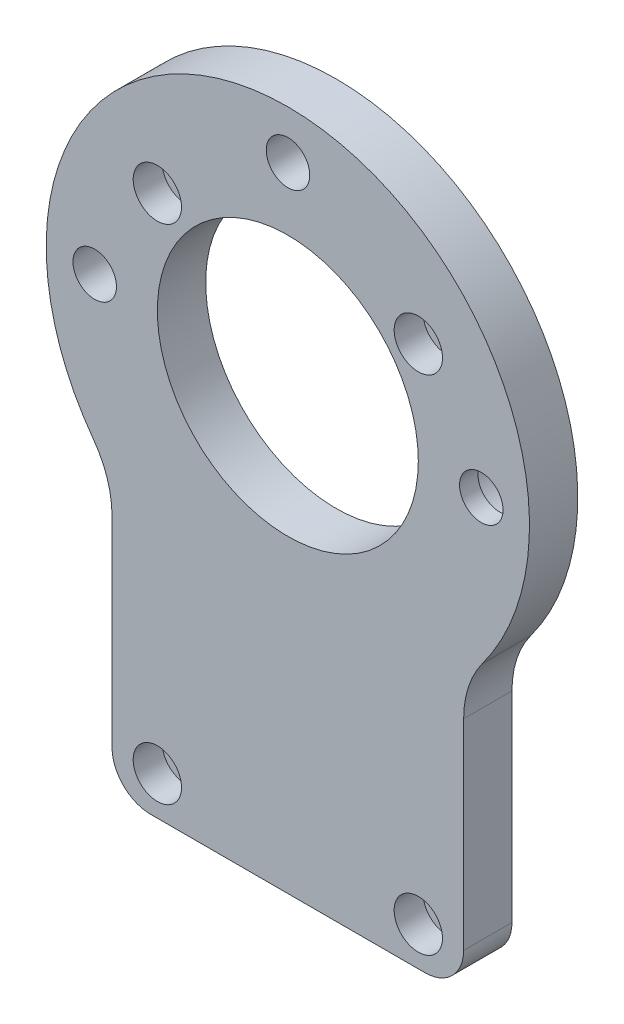
ISO-10303-21;
HEADER;
FILE_DESCRIPTION(('STEP AP214'),'2;1');
FILE_NAME('part.step','',(''),(''),'','','');
FILE_SCHEMA(('AUTOMOTIVE_DESIGN { 1 0 10303 214 1 1 1 1 }'));
ENDSEC;
DATA;
#1=APPLICATION_CONTEXT('core data for automotive mechanical design processes');
#2=APPLICATION_PROTOCOL_DEFINITION('international standard','automotive_design',2000,#1);
#3=PRODUCT_CONTEXT('',#1,'mechanical');
#4=PRODUCT('Part','Part','',(#3));
#5=PRODUCT_RELATED_PRODUCT_CATEGORY('part','',(#4));
#6=PRODUCT_DEFINITION_FORMATION('','',#4);
#7=PRODUCT_DEFINITION_CONTEXT('part definition',#1,'design');
#8=PRODUCT_DEFINITION('design','',#6,#7);
#9=PRODUCT_DEFINITION_SHAPE('','',#8);
#10=(LENGTH_UNIT() NAMED_UNIT(*) SI_UNIT(.MILLI.,.METRE.));
#11=(NAMED_UNIT(*) PLANE_ANGLE_UNIT() SI_UNIT($,.RADIAN.));
#12=(NAMED_UNIT(*) SI_UNIT($,.STERADIAN.) SOLID_ANGLE_UNIT());
#13=UNCERTAINTY_MEASURE_WITH_UNIT(LENGTH_MEASURE(1.E-05),#10,'distance_accuracy_value','');
#14=(GEOMETRIC_REPRESENTATION_CONTEXT(3) GLOBAL_UNCERTAINTY_ASSIGNED_CONTEXT((#13)) GLOBAL_UNIT_ASSIGNED_CONTEXT((#10,
#11,#12)) REPRESENTATION_CONTEXT('',''));
#15=CARTESIAN_POINT('',(0.,0.,0.));
#16=DIRECTION('',(0.,0.,1.));
#17=DIRECTION('',(1.,0.,0.));
#18=AXIS2_PLACEMENT_3D('',#15,#16,#17);
#19=CARTESIAN_POINT('',(0.,0.,0.));
#20=DIRECTION('',(0.,0.,1.));
#21=DIRECTION('',(1.,0.,0.));
#22=AXIS2_PLACEMENT_3D('',#19,#20,#21);
#23=PLANE('',#22);
#24=CARTESIAN_POINT('',(-19.9828483210245,15.4999999999999,0.));
#25=DIRECTION('',(0.,0.,1.));
#26=DIRECTION('',(1.,0.,0.));
#27=AXIS2_PLACEMENT_3D('',#24,#25,#26);
#28=CIRCLE('',#27,2.25);
#29=CARTESIAN_POINT('',(-17.7328483210245,15.4999999999999,0.));
#30=VERTEX_POINT('',#29);
#31=EDGE_CURVE('E262',#30,#30,#28,.T.);
#32=ORIENTED_EDGE('',*,*,#31,.T.);
#33=EDGE_LOOP('',(#32));
#34=FACE_BOUND('',#33,.T.);
#35=CARTESIAN_POINT('',(0.0171516789755077,35.5,0.));
#36=DIRECTION('',(0.,0.,1.));
#37=DIRECTION('',(1.,0.,0.));
#38=AXIS2_PLACEMENT_3D('',#35,#36,#37);
#39=CIRCLE('',#38,2.25);
#40=CARTESIAN_POINT('',(2.26715167897551,35.5,0.));
#41=VERTEX_POINT('',#40);
#42=EDGE_CURVE('E261',#41,#41,#39,.T.);
#43=ORIENTED_EDGE('',*,*,#42,.T.);
#44=EDGE_LOOP('',(#43));
#45=FACE_BOUND('',#44,.T.);
#46=CARTESIAN_POINT('',(0.,15.5,0.));
#47=DIRECTION('',(0.,0.,1.));
#48=DIRECTION('',(1.,0.,0.));
#49=AXIS2_PLACEMENT_3D('',#46,#47,#48);
#50=CIRCLE('',#49,13.5);
#51=CARTESIAN_POINT('',(13.5,15.5,0.));
#52=VERTEX_POINT('',#51);
#53=EDGE_CURVE('E139',#52,#52,#50,.T.);
#54=ORIENTED_EDGE('',*,*,#53,.T.);
#55=EDGE_LOOP('',(#54));
#56=FACE_BOUND('',#55,.T.);
#57=CARTESIAN_POINT('',(13.5,26.,0.));
#58=DIRECTION('',(0.,0.,1.));
#59=DIRECTION('',(1.,0.,0.));
#60=AXIS2_PLACEMENT_3D('',#57,#58,#59);
#61=CIRCLE('',#60,1.2);
#62=CARTESIAN_POINT('',(14.7,26.,0.));
#63=VERTEX_POINT('',#62);
#64=EDGE_CURVE('E142',#63,#63,#61,.T.);
#65=ORIENTED_EDGE('',*,*,#64,.T.);
#66=EDGE_LOOP('',(#65));
#67=FACE_BOUND('',#66,.T.);
#68=CARTESIAN_POINT('',(13.5,-26.,0.));
#69=DIRECTION('',(0.,0.,1.));
#70=DIRECTION('',(1.,0.,0.));
#71=AXIS2_PLACEMENT_3D('',#68,#69,#70);
#72=CIRCLE('',#71,1.2);
#73=CARTESIAN_POINT('',(14.7,-26.,0.));
#74=VERTEX_POINT('',#73);
#75=EDGE_CURVE('E145',#74,#74,#72,.T.);
#76=ORIENTED_EDGE('',*,*,#75,.T.);
#77=EDGE_LOOP('',(#76));
#78=FACE_BOUND('',#77,.T.);
#79=CARTESIAN_POINT('',(-13.5,-26.,0.));
#80=DIRECTION('',(0.,0.,1.));
#81=DIRECTION('',(1.,0.,0.));
#82=AXIS2_PLACEMENT_3D('',#79,#80,#81);
#83=CIRCLE('',#82,1.2);
#84=CARTESIAN_POINT('',(-12.3,-26.,0.));
#85=VERTEX_POINT('',#84);
#86=EDGE_CURVE('E148',#85,#85,#83,.T.);
#87=ORIENTED_EDGE('',*,*,#86,.T.);
#88=EDGE_LOOP('',(#87));
#89=FACE_BOUND('',#88,.T.);
#90=CARTESIAN_POINT('',(-28.1886362872403,-5.24610286935067,0.));
#91=DIRECTION('',(0.,0.,1.));
#92=DIRECTION('',(1.,0.,0.));
#93=AXIS2_PLACEMENT_3D('',#90,#91,#92);
#94=CIRCLE('',#93,10.);
#95=CARTESIAN_POINT('',(-18.1886362872403,-5.24610286935067,0.));
#96=VERTEX_POINT('',#95);
#97=CARTESIAN_POINT('',(-20.1347402051717,0.681355093320964,0.));
#98=VERTEX_POINT('',#97);
#99=EDGE_CURVE('E151',#96,#98,#94,.T.);
#100=ORIENTED_EDGE('',*,*,#99,.T.);
#101=CARTESIAN_POINT('',(0.,15.5,0.));
#102=DIRECTION('',(0.,0.,1.));
#103=DIRECTION('',(1.,0.,0.));
#104=AXIS2_PLACEMENT_3D('',#101,#102,#103);
#105=CIRCLE('',#104,25.);
#106=CARTESIAN_POINT('',(20.1347402051716,0.681355093320922,0.));
#107=VERTEX_POINT('',#106);
#108=EDGE_CURVE('E85',#107,#98,#105,.T.);
#109=ORIENTED_EDGE('',*,*,#108,.F.);
#110=CARTESIAN_POINT('',(28.1886362872403,-5.2461028693507,0.));
#111=DIRECTION('',(0.,0.,1.));
#112=DIRECTION('',(1.,0.,0.));
#113=AXIS2_PLACEMENT_3D('',#110,#111,#112);
#114=CIRCLE('',#113,10.);
#115=CARTESIAN_POINT('',(18.1886362872403,-5.2461028693507,0.));
#116=VERTEX_POINT('',#115);
#117=EDGE_CURVE('E166',#116,#107,#114,.F.);
#118=ORIENTED_EDGE('',*,*,#117,.F.);
#119=DIRECTION('',(0.,-1.,0.));
#120=VECTOR('',#119,1.);
#121=CARTESIAN_POINT('',(18.1886362872403,0.,0.));
#122=LINE('',#121,#120);
#123=CARTESIAN_POINT('',(18.1886362872403,-26.,0.));
#124=VERTEX_POINT('',#123);
#125=EDGE_CURVE('E118',#116,#124,#122,.T.);
#126=ORIENTED_EDGE('',*,*,#125,.T.);
#127=CARTESIAN_POINT('',(14.1886362872403,-26.,0.));
#128=DIRECTION('',(0.,0.,1.));
#129=DIRECTION('',(1.,0.,0.));
#130=AXIS2_PLACEMENT_3D('',#127,#128,#129);
#131=CIRCLE('',#130,4.);
#132=CARTESIAN_POINT('',(14.1886362872403,-30.,0.));
#133=VERTEX_POINT('',#132);
#134=EDGE_CURVE('E162',#124,#133,#131,.F.);
#135=ORIENTED_EDGE('',*,*,#134,.T.);
#136=DIRECTION('',(-1.,0.,0.));
#137=VECTOR('',#136,1.);
#138=CARTESIAN_POINT('',(0.,-30.,0.));
#139=LINE('',#138,#137);
#140=CARTESIAN_POINT('',(-14.1886362872403,-30.,0.));
#141=VERTEX_POINT('',#140);
#142=EDGE_CURVE('E159',#133,#141,#139,.T.);
#143=ORIENTED_EDGE('',*,*,#142,.T.);
#144=CARTESIAN_POINT('',(-14.1886362872403,-26.,0.));
#145=DIRECTION('',(0.,0.,1.));
#146=DIRECTION('',(1.,0.,0.));
#147=AXIS2_PLACEMENT_3D('',#144,#145,#146);
#148=CIRCLE('',#147,4.);
#149=CARTESIAN_POINT('',(-18.1886362872403,-26.,0.));
#150=VERTEX_POINT('',#149);
#151=EDGE_CURVE('E156',#141,#150,#148,.F.);
#152=ORIENTED_EDGE('',*,*,#151,.T.);
#153=DIRECTION('',(0.,-1.,0.));
#154=VECTOR('',#153,1.);
#155=CARTESIAN_POINT('',(-18.1886362872403,0.,0.));
#156=LINE('',#155,#154);
#157=EDGE_CURVE('E153',#96,#150,#156,.T.);
#158=ORIENTED_EDGE('',*,*,#157,.F.);
#159=EDGE_LOOP('',(#100,#109,#118,#126,#135,#143,#152,#158));
#160=FACE_BOUND('',#159,.T.);
#161=CARTESIAN_POINT('',(-13.5,26.,0.));
#162=DIRECTION('',(0.,0.,1.));
#163=DIRECTION('',(1.,0.,0.));
#164=AXIS2_PLACEMENT_3D('',#161,#162,#163);
#165=CIRCLE('',#164,1.2);
#166=CARTESIAN_POINT('',(-12.3,26.,0.));
#167=VERTEX_POINT('',#166);
#168=EDGE_CURVE('E169',#167,#167,#165,.T.);
#169=ORIENTED_EDGE('',*,*,#168,.T.);
#170=EDGE_LOOP('',(#169));
#171=FACE_BOUND('',#170,.T.);
#172=CARTESIAN_POINT('',(20.0171516789755,15.4999999999999,0.));
#173=DIRECTION('',(0.,0.,-1.));
#174=DIRECTION('',(-1.,0.,0.));
#175=AXIS2_PLACEMENT_3D('',#172,#173,#174);
#176=CIRCLE('',#175,4.49999999999999);
#177=CARTESIAN_POINT('',(15.5171516789755,15.4999999999999,0.));
#178=VERTEX_POINT('',#177);
#179=EDGE_CURVE('E248',#178,#178,#176,.T.);
#180=ORIENTED_EDGE('',*,*,#179,.F.);
#181=EDGE_LOOP('',(#180));
#182=FACE_BOUND('',#181,.T.);
#183=ADVANCED_FACE('F38',(#34,#45,#56,#67,#78,#89,#160,#171,#182),#23,.F.);
#184=CARTESIAN_POINT('',(-13.5,-26.,5.));
#185=DIRECTION('',(0.,0.,-1.));
#186=DIRECTION('',(-1.,0.,0.));
#187=AXIS2_PLACEMENT_3D('',#184,#185,#186);
#188=CYLINDRICAL_SURFACE('',#187,1.2);
#189=ORIENTED_EDGE('',*,*,#86,.F.);
#190=EDGE_LOOP('',(#189));
#191=FACE_BOUND('',#190,.T.);
#192=CARTESIAN_POINT('',(-13.5,-26.,2.));
#193=DIRECTION('',(0.,0.,1.));
#194=DIRECTION('',(1.,0.,0.));
#195=AXIS2_PLACEMENT_3D('',#192,#193,#194);
#196=CIRCLE('',#195,1.2);
#197=CARTESIAN_POINT('',(-12.3,-26.,2.));
#198=VERTEX_POINT('',#197);
#199=EDGE_CURVE('E42',#198,#198,#196,.T.);
#200=ORIENTED_EDGE('',*,*,#199,.T.);
#201=EDGE_LOOP('',(#200));
#202=FACE_BOUND('',#201,.T.);
#203=ADVANCED_FACE('F194',(#191,#202),#188,.F.);
#204=CARTESIAN_POINT('',(13.5,-26.,5.));
#205=DIRECTION('',(0.,0.,-1.));
#206=DIRECTION('',(-1.,0.,0.));
#207=AXIS2_PLACEMENT_3D('',#204,#205,#206);
#208=CYLINDRICAL_SURFACE('',#207,1.2);
#209=ORIENTED_EDGE('',*,*,#75,.F.);
#210=EDGE_LOOP('',(#209));
#211=FACE_BOUND('',#210,.T.);
#212=CARTESIAN_POINT('',(13.5,-26.,2.));
#213=DIRECTION('',(0.,0.,1.));
#214=DIRECTION('',(1.,0.,0.));
#215=AXIS2_PLACEMENT_3D('',#212,#213,#214);
#216=CIRCLE('',#215,1.2);
#217=CARTESIAN_POINT('',(14.7,-26.,2.));
#218=VERTEX_POINT('',#217);
#219=EDGE_CURVE('E187',#218,#218,#216,.T.);
#220=ORIENTED_EDGE('',*,*,#219,.T.);
#221=EDGE_LOOP('',(#220));
#222=FACE_BOUND('',#221,.T.);
#223=ADVANCED_FACE('F313',(#211,#222),#208,.F.);
#224=CARTESIAN_POINT('',(13.5,26.,5.));
#225=DIRECTION('',(0.,0.,-1.));
#226=DIRECTION('',(-1.,0.,0.));
#227=AXIS2_PLACEMENT_3D('',#224,#225,#226);
#228=CYLINDRICAL_SURFACE('',#227,1.2);
#229=ORIENTED_EDGE('',*,*,#64,.F.);
#230=EDGE_LOOP('',(#229));
#231=FACE_BOUND('',#230,.T.);
#232=CARTESIAN_POINT('',(13.5,26.,2.));
#233=DIRECTION('',(0.,0.,1.));
#234=DIRECTION('',(1.,0.,0.));
#235=AXIS2_PLACEMENT_3D('',#232,#233,#234);
#236=CIRCLE('',#235,1.2);
#237=CARTESIAN_POINT('',(14.7,26.,2.));
#238=VERTEX_POINT('',#237);
#239=EDGE_CURVE('E184',#238,#238,#236,.T.);
#240=ORIENTED_EDGE('',*,*,#239,.T.);
#241=EDGE_LOOP('',(#240));
#242=FACE_BOUND('',#241,.T.);
#243=ADVANCED_FACE('F318',(#231,#242),#228,.F.);
#244=CARTESIAN_POINT('',(-13.5,26.,5.));
#245=DIRECTION('',(0.,0.,-1.));
#246=DIRECTION('',(-1.,0.,0.));
#247=AXIS2_PLACEMENT_3D('',#244,#245,#246);
#248=CYLINDRICAL_SURFACE('',#247,1.2);
#249=ORIENTED_EDGE('',*,*,#168,.F.);
#250=EDGE_LOOP('',(#249));
#251=FACE_BOUND('',#250,.T.);
#252=CARTESIAN_POINT('',(-13.5,26.,2.));
#253=DIRECTION('',(0.,0.,1.));
#254=DIRECTION('',(1.,0.,0.));
#255=AXIS2_PLACEMENT_3D('',#252,#253,#254);
#256=CIRCLE('',#255,1.2);
#257=CARTESIAN_POINT('',(-12.3,26.,2.));
#258=VERTEX_POINT('',#257);
#259=EDGE_CURVE('E181',#258,#258,#256,.T.);
#260=ORIENTED_EDGE('',*,*,#259,.T.);
#261=EDGE_LOOP('',(#260));
#262=FACE_BOUND('',#261,.T.);
#263=ADVANCED_FACE('F325',(#251,#262),#248,.F.);
#264=CARTESIAN_POINT('',(-28.1886362872403,-5.24610286935067,5.));
#265=DIRECTION('',(0.,0.,-1.));
#266=DIRECTION('',(-1.,0.,0.));
#267=AXIS2_PLACEMENT_3D('',#264,#265,#266);
#268=CYLINDRICAL_SURFACE('',#267,10.);
#269=ORIENTED_EDGE('',*,*,#99,.F.);
#270=DIRECTION('',(0.,0.,-1.));
#271=VECTOR('',#270,1.);
#272=CARTESIAN_POINT('',(-18.1886362872403,-5.24610286935067,5.));
#273=LINE('',#272,#271);
#274=CARTESIAN_POINT('',(-18.1886362872403,-5.24610286935067,5.));
#275=VERTEX_POINT('',#274);
#276=EDGE_CURVE('E11',#275,#96,#273,.T.);
#277=ORIENTED_EDGE('',*,*,#276,.F.);
#278=CARTESIAN_POINT('',(-28.1886362872403,-5.24610286935067,5.));
#279=DIRECTION('',(0.,0.,1.));
#280=DIRECTION('',(1.,0.,0.));
#281=AXIS2_PLACEMENT_3D('',#278,#279,#280);
#282=CIRCLE('',#281,10.);
#283=CARTESIAN_POINT('',(-20.1347402051717,0.681355093320964,5.));
#284=VERTEX_POINT('',#283);
#285=EDGE_CURVE('E224',#275,#284,#282,.T.);
#286=ORIENTED_EDGE('',*,*,#285,.T.);
#287=DIRECTION('',(0.,0.,-1.));
#288=VECTOR('',#287,1.);
#289=CARTESIAN_POINT('',(-20.1347402051717,0.681355093320964,5.));
#290=LINE('',#289,#288);
#291=EDGE_CURVE('E92',#284,#98,#290,.T.);
#292=ORIENTED_EDGE('',*,*,#291,.T.);
#293=EDGE_LOOP('',(#269,#277,#286,#292));
#294=FACE_BOUND('',#293,.T.);
#295=ADVANCED_FACE('F322',(#294),#268,.F.);
#296=CARTESIAN_POINT('',(-18.1886362872403,0.,5.));
#297=DIRECTION('',(1.,0.,0.));
#298=DIRECTION('',(0.,1.,0.));
#299=AXIS2_PLACEMENT_3D('',#296,#297,#298);
#300=PLANE('',#299);
#301=ORIENTED_EDGE('',*,*,#157,.T.);
#302=DIRECTION('',(0.,0.,-1.));
#303=VECTOR('',#302,1.);
#304=CARTESIAN_POINT('',(-18.1886362872403,-26.,5.));
#305=LINE('',#304,#303);
#306=CARTESIAN_POINT('',(-18.1886362872403,-26.,5.));
#307=VERTEX_POINT('',#306);
#308=EDGE_CURVE('E48',#307,#150,#305,.T.);
#309=ORIENTED_EDGE('',*,*,#308,.F.);
#310=DIRECTION('',(0.,-1.,0.));
#311=VECTOR('',#310,1.);
#312=CARTESIAN_POINT('',(-18.1886362872403,0.,5.));
#313=LINE('',#312,#311);
#314=EDGE_CURVE('E226',#275,#307,#313,.T.);
#315=ORIENTED_EDGE('',*,*,#314,.F.);
#316=ORIENTED_EDGE('',*,*,#276,.T.);
#317=EDGE_LOOP('',(#301,#309,#315,#316));
#318=FACE_BOUND('',#317,.T.);
#319=ADVANCED_FACE('F371',(#318),#300,.F.);
#320=CARTESIAN_POINT('',(-14.1886362872403,-26.,5.));
#321=DIRECTION('',(0.,0.,-1.));
#322=DIRECTION('',(-1.,0.,0.));
#323=AXIS2_PLACEMENT_3D('',#320,#321,#322);
#324=CYLINDRICAL_SURFACE('',#323,4.);
#325=ORIENTED_EDGE('',*,*,#151,.F.);
#326=DIRECTION('',(0.,0.,-1.));
#327=VECTOR('',#326,1.);
#328=CARTESIAN_POINT('',(-14.1886362872403,-30.,5.));
#329=LINE('',#328,#327);
#330=CARTESIAN_POINT('',(-14.1886362872403,-30.,5.));
#331=VERTEX_POINT('',#330);
#332=EDGE_CURVE('E178',#331,#141,#329,.T.);
#333=ORIENTED_EDGE('',*,*,#332,.F.);
#334=CARTESIAN_POINT('',(-14.1886362872403,-26.,5.));
#335=DIRECTION('',(0.,0.,1.));
#336=DIRECTION('',(1.,0.,0.));
#337=AXIS2_PLACEMENT_3D('',#334,#335,#336);
#338=CIRCLE('',#337,4.);
#339=EDGE_CURVE('E228',#331,#307,#338,.F.);
#340=ORIENTED_EDGE('',*,*,#339,.T.);
#341=ORIENTED_EDGE('',*,*,#308,.T.);
#342=EDGE_LOOP('',(#325,#333,#340,#341));
#343=FACE_BOUND('',#342,.T.);
#344=ADVANCED_FACE('F369',(#343),#324,.T.);
#345=CARTESIAN_POINT('',(0.,-30.,5.));
#346=DIRECTION('',(0.,-1.,0.));
#347=DIRECTION('',(1.,0.,0.));
#348=AXIS2_PLACEMENT_3D('',#345,#346,#347);
#349=PLANE('',#348);
#350=ORIENTED_EDGE('',*,*,#142,.F.);
#351=DIRECTION('',(0.,0.,-1.));
#352=VECTOR('',#351,1.);
#353=CARTESIAN_POINT('',(14.1886362872403,-30.,5.));
#354=LINE('',#353,#352);
#355=CARTESIAN_POINT('',(14.1886362872403,-30.,5.));
#356=VERTEX_POINT('',#355);
#357=EDGE_CURVE('E176',#356,#133,#354,.T.);
#358=ORIENTED_EDGE('',*,*,#357,.F.);
#359=DIRECTION('',(-1.,0.,0.));
#360=VECTOR('',#359,1.);
#361=CARTESIAN_POINT('',(0.,-30.,5.));
#362=LINE('',#361,#360);
#363=EDGE_CURVE('E134',#356,#331,#362,.T.);
#364=ORIENTED_EDGE('',*,*,#363,.T.);
#365=ORIENTED_EDGE('',*,*,#332,.T.);
#366=EDGE_LOOP('',(#350,#358,#364,#365));
#367=FACE_BOUND('',#366,.T.);
#368=ADVANCED_FACE('F233',(#367),#349,.T.);
#369=CARTESIAN_POINT('',(14.1886362872403,-26.,5.));
#370=DIRECTION('',(0.,0.,-1.));
#371=DIRECTION('',(-1.,0.,0.));
#372=AXIS2_PLACEMENT_3D('',#369,#370,#371);
#373=CYLINDRICAL_SURFACE('',#372,4.);
#374=ORIENTED_EDGE('',*,*,#134,.F.);
#375=DIRECTION('',(0.,0.,-1.));
#376=VECTOR('',#375,1.);
#377=CARTESIAN_POINT('',(18.1886362872403,-26.,5.));
#378=LINE('',#377,#376);
#379=CARTESIAN_POINT('',(18.1886362872403,-26.,5.));
#380=VERTEX_POINT('',#379);
#381=EDGE_CURVE('E121',#380,#124,#378,.T.);
#382=ORIENTED_EDGE('',*,*,#381,.F.);
#383=CARTESIAN_POINT('',(14.1886362872403,-26.,5.));
#384=DIRECTION('',(0.,0.,1.));
#385=DIRECTION('',(1.,0.,0.));
#386=AXIS2_PLACEMENT_3D('',#383,#384,#385);
#387=CIRCLE('',#386,4.);
#388=EDGE_CURVE('E132',#380,#356,#387,.F.);
#389=ORIENTED_EDGE('',*,*,#388,.T.);
#390=ORIENTED_EDGE('',*,*,#357,.T.);
#391=EDGE_LOOP('',(#374,#382,#389,#390));
#392=FACE_BOUND('',#391,.T.);
#393=ADVANCED_FACE('F238',(#392),#373,.T.);
#394=CARTESIAN_POINT('',(18.1886362872403,0.,5.));
#395=DIRECTION('',(1.,0.,0.));
#396=DIRECTION('',(0.,1.,0.));
#397=AXIS2_PLACEMENT_3D('',#394,#395,#396);
#398=PLANE('',#397);
#399=ORIENTED_EDGE('',*,*,#125,.F.);
#400=DIRECTION('',(0.,0.,-1.));
#401=VECTOR('',#400,1.);
#402=CARTESIAN_POINT('',(18.1886362872403,-5.2461028693507,5.));
#403=LINE('',#402,#401);
#404=CARTESIAN_POINT('',(18.1886362872403,-5.2461028693507,5.));
#405=VERTEX_POINT('',#404);
#406=EDGE_CURVE('E112',#405,#116,#403,.T.);
#407=ORIENTED_EDGE('',*,*,#406,.F.);
#408=DIRECTION('',(0.,-1.,0.));
#409=VECTOR('',#408,1.);
#410=CARTESIAN_POINT('',(18.1886362872403,0.,5.));
#411=LINE('',#410,#409);
#412=EDGE_CURVE('E116',#405,#380,#411,.T.);
#413=ORIENTED_EDGE('',*,*,#412,.T.);
#414=ORIENTED_EDGE('',*,*,#381,.T.);
#415=EDGE_LOOP('',(#399,#407,#413,#414));
#416=FACE_BOUND('',#415,.T.);
#417=ADVANCED_FACE('F114',(#416),#398,.T.);
#418=CARTESIAN_POINT('',(28.1886362872403,-5.2461028693507,5.));
#419=DIRECTION('',(0.,0.,-1.));
#420=DIRECTION('',(-1.,0.,0.));
#421=AXIS2_PLACEMENT_3D('',#418,#419,#420);
#422=CYLINDRICAL_SURFACE('',#421,10.);
#423=ORIENTED_EDGE('',*,*,#117,.T.);
#424=DIRECTION('',(0.,0.,-1.));
#425=VECTOR('',#424,1.);
#426=CARTESIAN_POINT('',(20.1347402051716,0.681355093320922,5.));
#427=LINE('',#426,#425);
#428=CARTESIAN_POINT('',(20.1347402051716,0.681355093320922,5.));
#429=VERTEX_POINT('',#428);
#430=EDGE_CURVE('E122',#429,#107,#427,.T.);
#431=ORIENTED_EDGE('',*,*,#430,.F.);
#432=CARTESIAN_POINT('',(28.1886362872403,-5.2461028693507,5.));
#433=DIRECTION('',(0.,0.,1.));
#434=DIRECTION('',(1.,0.,0.));
#435=AXIS2_PLACEMENT_3D('',#432,#433,#434);
#436=CIRCLE('',#435,10.);
#437=EDGE_CURVE('E125',#405,#429,#436,.F.);
#438=ORIENTED_EDGE('',*,*,#437,.F.);
#439=ORIENTED_EDGE('',*,*,#406,.T.);
#440=EDGE_LOOP('',(#423,#431,#438,#439));
#441=FACE_BOUND('',#440,.T.);
#442=ADVANCED_FACE('F126',(#441),#422,.F.);
#443=CARTESIAN_POINT('',(0.,15.5,5.));
#444=DIRECTION('',(0.,0.,-1.));
#445=DIRECTION('',(-1.,0.,0.));
#446=AXIS2_PLACEMENT_3D('',#443,#444,#445);
#447=CYLINDRICAL_SURFACE('',#446,25.);
#448=ORIENTED_EDGE('',*,*,#108,.T.);
#449=ORIENTED_EDGE('',*,*,#291,.F.);
#450=CARTESIAN_POINT('',(0.,15.5,5.));
#451=DIRECTION('',(0.,0.,1.));
#452=DIRECTION('',(1.,0.,0.));
#453=AXIS2_PLACEMENT_3D('',#450,#451,#452);
#454=CIRCLE('',#453,25.);
#455=EDGE_CURVE('E57',#429,#284,#454,.T.);
#456=ORIENTED_EDGE('',*,*,#455,.F.);
#457=ORIENTED_EDGE('',*,*,#430,.T.);
#458=EDGE_LOOP('',(#448,#449,#456,#457));
#459=FACE_BOUND('',#458,.T.);
#460=ADVANCED_FACE('F302',(#459),#447,.T.);
#461=CARTESIAN_POINT('',(0.,15.5,5.));
#462=DIRECTION('',(0.,0.,-1.));
#463=DIRECTION('',(-1.,0.,0.));
#464=AXIS2_PLACEMENT_3D('',#461,#462,#463);
#465=CYLINDRICAL_SURFACE('',#464,13.5);
#466=CARTESIAN_POINT('',(0.,15.5,5.));
#467=DIRECTION('',(0.,0.,1.));
#468=DIRECTION('',(1.,0.,0.));
#469=AXIS2_PLACEMENT_3D('',#466,#467,#468);
#470=CIRCLE('',#469,13.5);
#471=CARTESIAN_POINT('',(13.5,15.5,5.));
#472=VERTEX_POINT('',#471);
#473=EDGE_CURVE('E172',#472,#472,#470,.T.);
#474=ORIENTED_EDGE('',*,*,#473,.T.);
#475=EDGE_LOOP('',(#474));
#476=FACE_BOUND('',#475,.T.);
#477=ORIENTED_EDGE('',*,*,#53,.F.);
#478=EDGE_LOOP('',(#477));
#479=FACE_BOUND('',#478,.T.);
#480=ADVANCED_FACE('F40',(#476,#479),#465,.F.);
#481=CARTESIAN_POINT('',(0.,0.,5.));
#482=DIRECTION('',(0.,0.,1.));
#483=DIRECTION('',(1.,0.,0.));
#484=AXIS2_PLACEMENT_3D('',#481,#482,#483);
#485=PLANE('',#484);
#486=CARTESIAN_POINT('',(20.0171516789755,15.4999999999999,5.));
#487=DIRECTION('',(0.,0.,-1.));
#488=DIRECTION('',(-1.,0.,0.));
#489=AXIS2_PLACEMENT_3D('',#486,#487,#488);
#490=CIRCLE('',#489,2.25);
#491=CARTESIAN_POINT('',(17.7671516789755,15.4999999999999,5.));
#492=VERTEX_POINT('',#491);
#493=EDGE_CURVE('E258',#492,#492,#490,.T.);
#494=ORIENTED_EDGE('',*,*,#493,.T.);
#495=EDGE_LOOP('',(#494));
#496=FACE_BOUND('',#495,.T.);
#497=CARTESIAN_POINT('',(-19.9828483210245,15.4999999999999,5.));
#498=DIRECTION('',(0.,0.,1.));
#499=DIRECTION('',(1.,0.,0.));
#500=AXIS2_PLACEMENT_3D('',#497,#498,#499);
#501=CIRCLE('',#500,2.25);
#502=CARTESIAN_POINT('',(-17.7328483210245,15.4999999999999,5.));
#503=VERTEX_POINT('',#502);
#504=EDGE_CURVE('E270',#503,#503,#501,.T.);
#505=ORIENTED_EDGE('',*,*,#504,.F.);
#506=EDGE_LOOP('',(#505));
#507=FACE_BOUND('',#506,.T.);
#508=CARTESIAN_POINT('',(0.0171516789755077,35.5,5.));
#509=DIRECTION('',(0.,0.,1.));
#510=DIRECTION('',(1.,0.,0.));
#511=AXIS2_PLACEMENT_3D('',#508,#509,#510);
#512=CIRCLE('',#511,2.25);
#513=CARTESIAN_POINT('',(2.26715167897551,35.5,5.));
#514=VERTEX_POINT('',#513);
#515=EDGE_CURVE('E265',#514,#514,#512,.T.);
#516=ORIENTED_EDGE('',*,*,#515,.F.);
#517=EDGE_LOOP('',(#516));
#518=FACE_BOUND('',#517,.T.);
#519=CARTESIAN_POINT('',(13.5,26.,5.));
#520=DIRECTION('',(0.,0.,1.));
#521=DIRECTION('',(1.,0.,0.));
#522=AXIS2_PLACEMENT_3D('',#519,#520,#521);
#523=CIRCLE('',#522,2.5);
#524=CARTESIAN_POINT('',(16.,26.,5.));
#525=VERTEX_POINT('',#524);
#526=EDGE_CURVE('E206',#525,#525,#523,.T.);
#527=ORIENTED_EDGE('',*,*,#526,.F.);
#528=EDGE_LOOP('',(#527));
#529=FACE_BOUND('',#528,.T.);
#530=CARTESIAN_POINT('',(-13.5,-26.,5.));
#531=DIRECTION('',(0.,0.,1.));
#532=DIRECTION('',(1.,0.,0.));
#533=AXIS2_PLACEMENT_3D('',#530,#531,#532);
#534=CIRCLE('',#533,2.5);
#535=CARTESIAN_POINT('',(-11.,-26.,5.));
#536=VERTEX_POINT('',#535);
#537=EDGE_CURVE('E207',#536,#536,#534,.T.);
#538=ORIENTED_EDGE('',*,*,#537,.F.);
#539=EDGE_LOOP('',(#538));
#540=FACE_BOUND('',#539,.T.);
#541=CARTESIAN_POINT('',(13.5,-26.,5.));
#542=DIRECTION('',(0.,0.,1.));
#543=DIRECTION('',(1.,0.,0.));
#544=AXIS2_PLACEMENT_3D('',#541,#542,#543);
#545=CIRCLE('',#544,2.5);
#546=CARTESIAN_POINT('',(16.,-26.,5.));
#547=VERTEX_POINT('',#546);
#548=EDGE_CURVE('E273',#547,#547,#545,.T.);
#549=ORIENTED_EDGE('',*,*,#548,.F.);
#550=EDGE_LOOP('',(#549));
#551=FACE_BOUND('',#550,.T.);
#552=CARTESIAN_POINT('',(-13.5,26.,5.));
#553=DIRECTION('',(0.,0.,1.));
#554=DIRECTION('',(1.,0.,0.));
#555=AXIS2_PLACEMENT_3D('',#552,#553,#554);
#556=CIRCLE('',#555,2.5);
#557=CARTESIAN_POINT('',(-11.,26.,5.));
#558=VERTEX_POINT('',#557);
#559=EDGE_CURVE('E219',#558,#558,#556,.T.);
#560=ORIENTED_EDGE('',*,*,#559,.F.);
#561=EDGE_LOOP('',(#560));
#562=FACE_BOUND('',#561,.T.);
#563=ORIENTED_EDGE('',*,*,#473,.F.);
#564=EDGE_LOOP('',(#563));
#565=FACE_BOUND('',#564,.T.);
#566=ORIENTED_EDGE('',*,*,#285,.F.);
#567=ORIENTED_EDGE('',*,*,#314,.T.);
#568=ORIENTED_EDGE('',*,*,#339,.F.);
#569=ORIENTED_EDGE('',*,*,#363,.F.);
#570=ORIENTED_EDGE('',*,*,#388,.F.);
#571=ORIENTED_EDGE('',*,*,#412,.F.);
#572=ORIENTED_EDGE('',*,*,#437,.T.);
#573=ORIENTED_EDGE('',*,*,#455,.T.);
#574=EDGE_LOOP('',(#566,#567,#568,#569,#570,#571,#572,#573));
#575=FACE_BOUND('',#574,.T.);
#576=ADVANCED_FACE('F129',(#496,#507,#518,#529,#540,#551,#562,#565,#575),#485,.T.);
#577=CARTESIAN_POINT('',(-13.5,26.,2.));
#578=DIRECTION('',(0.,0.,1.));
#579=DIRECTION('',(1.,0.,0.));
#580=AXIS2_PLACEMENT_3D('',#577,#578,#579);
#581=CYLINDRICAL_SURFACE('',#580,2.5);
#582=CARTESIAN_POINT('',(-13.5,26.,2.));
#583=DIRECTION('',(0.,0.,1.));
#584=DIRECTION('',(1.,0.,0.));
#585=AXIS2_PLACEMENT_3D('',#582,#583,#584);
#586=CIRCLE('',#585,2.5);
#587=CARTESIAN_POINT('',(-11.,26.,2.));
#588=VERTEX_POINT('',#587);
#589=EDGE_CURVE('E185',#588,#588,#586,.T.);
#590=ORIENTED_EDGE('',*,*,#589,.F.);
#591=EDGE_LOOP('',(#590));
#592=FACE_BOUND('',#591,.T.);
#593=ORIENTED_EDGE('',*,*,#559,.T.);
#594=EDGE_LOOP('',(#593));
#595=FACE_BOUND('',#594,.T.);
#596=ADVANCED_FACE('F289',(#592,#595),#581,.F.);
#597=CARTESIAN_POINT('',(-13.5,26.,2.));
#598=DIRECTION('',(0.,0.,1.));
#599=DIRECTION('',(1.,0.,0.));
#600=AXIS2_PLACEMENT_3D('',#597,#598,#599);
#601=PLANE('',#600);
#602=ORIENTED_EDGE('',*,*,#259,.F.);
#603=EDGE_LOOP('',(#602));
#604=FACE_BOUND('',#603,.T.);
#605=ORIENTED_EDGE('',*,*,#589,.T.);
#606=EDGE_LOOP('',(#605));
#607=FACE_BOUND('',#606,.T.);
#608=ADVANCED_FACE('F351',(#604,#607),#601,.T.);
#609=CARTESIAN_POINT('',(13.5,-26.,2.));
#610=DIRECTION('',(0.,0.,1.));
#611=DIRECTION('',(1.,0.,0.));
#612=AXIS2_PLACEMENT_3D('',#609,#610,#611);
#613=CYLINDRICAL_SURFACE('',#612,2.5);
#614=CARTESIAN_POINT('',(13.5,-26.,2.));
#615=DIRECTION('',(0.,0.,1.));
#616=DIRECTION('',(1.,0.,0.));
#617=AXIS2_PLACEMENT_3D('',#614,#615,#616);
#618=CIRCLE('',#617,2.5);
#619=CARTESIAN_POINT('',(16.,-26.,2.));
#620=VERTEX_POINT('',#619);
#621=EDGE_CURVE('E213',#620,#620,#618,.T.);
#622=ORIENTED_EDGE('',*,*,#621,.F.);
#623=EDGE_LOOP('',(#622));
#624=FACE_BOUND('',#623,.T.);
#625=ORIENTED_EDGE('',*,*,#548,.T.);
#626=EDGE_LOOP('',(#625));
#627=FACE_BOUND('',#626,.T.);
#628=ADVANCED_FACE('F345',(#624,#627),#613,.F.);
#629=CARTESIAN_POINT('',(13.5,-26.,2.));
#630=DIRECTION('',(0.,0.,1.));
#631=DIRECTION('',(1.,0.,0.));
#632=AXIS2_PLACEMENT_3D('',#629,#630,#631);
#633=PLANE('',#632);
#634=ORIENTED_EDGE('',*,*,#219,.F.);
#635=EDGE_LOOP('',(#634));
#636=FACE_BOUND('',#635,.T.);
#637=ORIENTED_EDGE('',*,*,#621,.T.);
#638=EDGE_LOOP('',(#637));
#639=FACE_BOUND('',#638,.T.);
#640=ADVANCED_FACE('F350',(#636,#639),#633,.T.);
#641=CARTESIAN_POINT('',(-13.5,-26.,2.));
#642=DIRECTION('',(0.,0.,1.));
#643=DIRECTION('',(1.,0.,0.));
#644=AXIS2_PLACEMENT_3D('',#641,#642,#643);
#645=CYLINDRICAL_SURFACE('',#644,2.5);
#646=CARTESIAN_POINT('',(-13.5,-26.,2.));
#647=DIRECTION('',(0.,0.,1.));
#648=DIRECTION('',(1.,0.,0.));
#649=AXIS2_PLACEMENT_3D('',#646,#647,#648);
#650=CIRCLE('',#649,2.5);
#651=CARTESIAN_POINT('',(-11.,-26.,2.));
#652=VERTEX_POINT('',#651);
#653=EDGE_CURVE('E204',#652,#652,#650,.T.);
#654=ORIENTED_EDGE('',*,*,#653,.F.);
#655=EDGE_LOOP('',(#654));
#656=FACE_BOUND('',#655,.T.);
#657=ORIENTED_EDGE('',*,*,#537,.T.);
#658=EDGE_LOOP('',(#657));
#659=FACE_BOUND('',#658,.T.);
#660=ADVANCED_FACE('F200',(#656,#659),#645,.F.);
#661=CARTESIAN_POINT('',(-13.5,-26.,2.));
#662=DIRECTION('',(0.,0.,1.));
#663=DIRECTION('',(1.,0.,0.));
#664=AXIS2_PLACEMENT_3D('',#661,#662,#663);
#665=PLANE('',#664);
#666=ORIENTED_EDGE('',*,*,#199,.F.);
#667=EDGE_LOOP('',(#666));
#668=FACE_BOUND('',#667,.T.);
#669=ORIENTED_EDGE('',*,*,#653,.T.);
#670=EDGE_LOOP('',(#669));
#671=FACE_BOUND('',#670,.T.);
#672=ADVANCED_FACE('F196',(#668,#671),#665,.T.);
#673=CARTESIAN_POINT('',(13.5,26.,2.));
#674=DIRECTION('',(0.,0.,1.));
#675=DIRECTION('',(1.,0.,0.));
#676=AXIS2_PLACEMENT_3D('',#673,#674,#675);
#677=CYLINDRICAL_SURFACE('',#676,2.5);
#678=CARTESIAN_POINT('',(13.5,26.,2.));
#679=DIRECTION('',(0.,0.,1.));
#680=DIRECTION('',(1.,0.,0.));
#681=AXIS2_PLACEMENT_3D('',#678,#679,#680);
#682=CIRCLE('',#681,2.5);
#683=CARTESIAN_POINT('',(16.,26.,2.));
#684=VERTEX_POINT('',#683);
#685=EDGE_CURVE('E210',#684,#684,#682,.T.);
#686=ORIENTED_EDGE('',*,*,#685,.F.);
#687=EDGE_LOOP('',(#686));
#688=FACE_BOUND('',#687,.T.);
#689=ORIENTED_EDGE('',*,*,#526,.T.);
#690=EDGE_LOOP('',(#689));
#691=FACE_BOUND('',#690,.T.);
#692=ADVANCED_FACE('F199',(#688,#691),#677,.F.);
#693=CARTESIAN_POINT('',(13.5,26.,2.));
#694=DIRECTION('',(0.,0.,1.));
#695=DIRECTION('',(1.,0.,0.));
#696=AXIS2_PLACEMENT_3D('',#693,#694,#695);
#697=PLANE('',#696);
#698=ORIENTED_EDGE('',*,*,#239,.F.);
#699=EDGE_LOOP('',(#698));
#700=FACE_BOUND('',#699,.T.);
#701=ORIENTED_EDGE('',*,*,#685,.T.);
#702=EDGE_LOOP('',(#701));
#703=FACE_BOUND('',#702,.T.);
#704=ADVANCED_FACE('F280',(#700,#703),#697,.T.);
#705=CARTESIAN_POINT('',(0.0171516789755077,35.5,0.));
#706=DIRECTION('',(0.,0.,1.));
#707=DIRECTION('',(1.,0.,0.));
#708=AXIS2_PLACEMENT_3D('',#705,#706,#707);
#709=CYLINDRICAL_SURFACE('',#708,2.25);
#710=ORIENTED_EDGE('',*,*,#515,.T.);
#711=EDGE_LOOP('',(#710));
#712=FACE_BOUND('',#711,.T.);
#713=ORIENTED_EDGE('',*,*,#42,.F.);
#714=EDGE_LOOP('',(#713));
#715=FACE_BOUND('',#714,.T.);
#716=ADVANCED_FACE('F336',(#712,#715),#709,.F.);
#717=CARTESIAN_POINT('',(-19.9828483210245,15.4999999999999,0.));
#718=DIRECTION('',(0.,0.,1.));
#719=DIRECTION('',(1.,0.,0.));
#720=AXIS2_PLACEMENT_3D('',#717,#718,#719);
#721=CYLINDRICAL_SURFACE('',#720,2.25);
#722=ORIENTED_EDGE('',*,*,#504,.T.);
#723=EDGE_LOOP('',(#722));
#724=FACE_BOUND('',#723,.T.);
#725=ORIENTED_EDGE('',*,*,#31,.F.);
#726=EDGE_LOOP('',(#725));
#727=FACE_BOUND('',#726,.T.);
#728=ADVANCED_FACE('F341',(#724,#727),#721,.F.);
#729=CARTESIAN_POINT('',(20.0171516789755,15.4999999999999,0.));
#730=DIRECTION('',(0.,0.,-1.));
#731=DIRECTION('',(-1.,0.,0.));
#732=AXIS2_PLACEMENT_3D('',#729,#730,#731);
#733=CYLINDRICAL_SURFACE('',#732,2.25);
#734=ORIENTED_EDGE('',*,*,#493,.F.);
#735=EDGE_LOOP('',(#734));
#736=FACE_BOUND('',#735,.T.);
#737=CARTESIAN_POINT('',(20.0171516789755,15.4999999999999,3.1));
#738=DIRECTION('',(0.,0.,-1.));
#739=DIRECTION('',(-1.,0.,0.));
#740=AXIS2_PLACEMENT_3D('',#737,#738,#739);
#741=CIRCLE('',#740,2.25);
#742=CARTESIAN_POINT('',(17.7671516789755,15.4999999999999,3.1));
#743=VERTEX_POINT('',#742);
#744=EDGE_CURVE('E253',#743,#743,#741,.T.);
#745=ORIENTED_EDGE('',*,*,#744,.T.);
#746=EDGE_LOOP('',(#745));
#747=FACE_BOUND('',#746,.T.);
#748=ADVANCED_FACE('F455',(#736,#747),#733,.F.);
#749=CARTESIAN_POINT('',(22.2671516789755,15.4999999999999,3.1));
#750=DIRECTION('',(0.,0.,1.));
#751=DIRECTION('',(1.,0.,0.));
#752=AXIS2_PLACEMENT_3D('',#749,#750,#751);
#753=PLANE('',#752);
#754=ORIENTED_EDGE('',*,*,#744,.F.);
#755=EDGE_LOOP('',(#754));
#756=FACE_BOUND('',#755,.T.);
#757=CARTESIAN_POINT('',(20.0171516789755,15.4999999999999,3.1));
#758=DIRECTION('',(0.,0.,-1.));
#759=DIRECTION('',(-1.,0.,0.));
#760=AXIS2_PLACEMENT_3D('',#757,#758,#759);
#761=CIRCLE('',#760,4.49999999999999);
#762=CARTESIAN_POINT('',(15.5171516789755,15.4999999999999,3.1));
#763=VERTEX_POINT('',#762);
#764=EDGE_CURVE('E250',#763,#763,#761,.T.);
#765=ORIENTED_EDGE('',*,*,#764,.T.);
#766=EDGE_LOOP('',(#765));
#767=FACE_BOUND('',#766,.T.);
#768=ADVANCED_FACE('F479',(#756,#767),#753,.F.);
#769=CARTESIAN_POINT('',(20.0171516789755,15.4999999999999,0.));
#770=DIRECTION('',(0.,0.,-1.));
#771=DIRECTION('',(-1.,0.,0.));
#772=AXIS2_PLACEMENT_3D('',#769,#770,#771);
#773=CYLINDRICAL_SURFACE('',#772,4.49999999999999);
#774=ORIENTED_EDGE('',*,*,#764,.F.);
#775=EDGE_LOOP('',(#774));
#776=FACE_BOUND('',#775,.T.);
#777=ORIENTED_EDGE('',*,*,#179,.T.);
#778=EDGE_LOOP('',(#777));
#779=FACE_BOUND('',#778,.T.);
#780=ADVANCED_FACE('F489',(#776,#779),#773,.F.);
#781=CLOSED_SHELL('',(#183,#203,#223,#243,#263,#295,#319,#344,#368,#393,#417,#442,#460,#480,
#576,#596,#608,#628,#640,#660,#672,#692,#704,#716,#728,#748,#768,#780));
#782=MANIFOLD_SOLID_BREP('B2',#781);
#783=ADVANCED_BREP_SHAPE_REPRESENTATION('',(#18,#782),#14);
#784=SHAPE_DEFINITION_REPRESENTATION(#9,#783);
ENDSEC;
END-ISO-10303-21;
